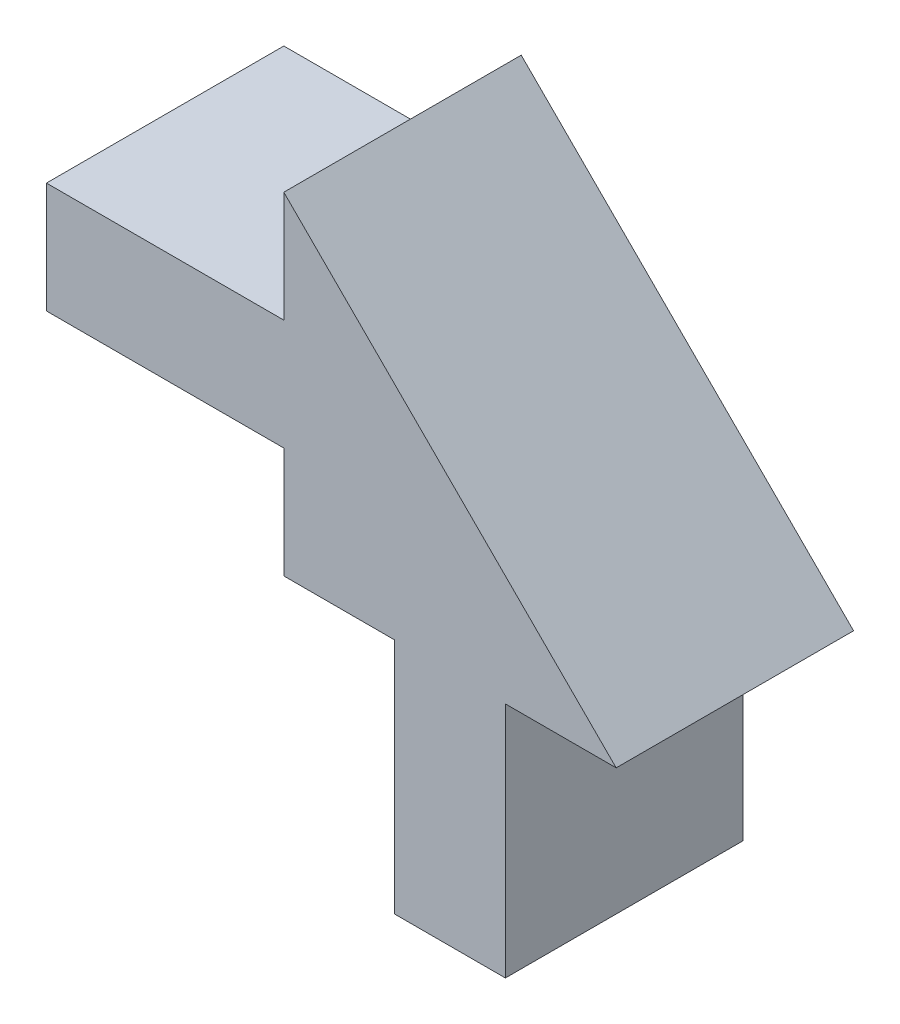
ISO-10303-21;
HEADER;
FILE_DESCRIPTION(('STEP AP214'),'2;1');
FILE_NAME('part.step','',(''),(''),'','','');
FILE_SCHEMA(('AUTOMOTIVE_DESIGN { 1 0 10303 214 1 1 1 1 }'));
ENDSEC;
DATA;
#1=APPLICATION_CONTEXT('core data for automotive mechanical design processes');
#2=APPLICATION_PROTOCOL_DEFINITION('international standard','automotive_design',2000,#1);
#3=PRODUCT_CONTEXT('',#1,'mechanical');
#4=PRODUCT('Part','Part','',(#3));
#5=PRODUCT_RELATED_PRODUCT_CATEGORY('part','',(#4));
#6=PRODUCT_DEFINITION_FORMATION('','',#4);
#7=PRODUCT_DEFINITION_CONTEXT('part definition',#1,'design');
#8=PRODUCT_DEFINITION('design','',#6,#7);
#9=PRODUCT_DEFINITION_SHAPE('','',#8);
#10=(LENGTH_UNIT() NAMED_UNIT(*) SI_UNIT(.MILLI.,.METRE.));
#11=(NAMED_UNIT(*) PLANE_ANGLE_UNIT() SI_UNIT($,.RADIAN.));
#12=(NAMED_UNIT(*) SI_UNIT($,.STERADIAN.) SOLID_ANGLE_UNIT());
#13=UNCERTAINTY_MEASURE_WITH_UNIT(LENGTH_MEASURE(1.E-05),#10,'distance_accuracy_value','');
#14=(GEOMETRIC_REPRESENTATION_CONTEXT(3) GLOBAL_UNCERTAINTY_ASSIGNED_CONTEXT((#13)) GLOBAL_UNIT_ASSIGNED_CONTEXT((#10,
#11,#12)) REPRESENTATION_CONTEXT('',''));
#15=CARTESIAN_POINT('',(0.,0.,0.));
#16=DIRECTION('',(0.,0.,1.));
#17=DIRECTION('',(1.,0.,0.));
#18=AXIS2_PLACEMENT_3D('',#15,#16,#17);
#19=CARTESIAN_POINT('',(0.,5.92666666666667,6.35));
#20=DIRECTION('',(-1.,0.,0.));
#21=DIRECTION('',(0.,0.,1.));
#22=AXIS2_PLACEMENT_3D('',#19,#20,#21);
#23=PLANE('',#22);
#24=DIRECTION('',(0.,1.,0.));
#25=VECTOR('',#24,1.);
#26=CARTESIAN_POINT('',(0.,5.92666666666667,0.));
#27=LINE('',#26,#25);
#28=CARTESIAN_POINT('',(0.,5.92666666666667,0.));
#29=VERTEX_POINT('',#28);
#30=CARTESIAN_POINT('',(0.,8.89,0.));
#31=VERTEX_POINT('',#30);
#32=EDGE_CURVE('E152',#29,#31,#27,.T.);
#33=ORIENTED_EDGE('',*,*,#32,.F.);
#34=DIRECTION('',(0.,0.,-1.));
#35=VECTOR('',#34,1.);
#36=CARTESIAN_POINT('',(0.,5.92666666666667,6.35));
#37=LINE('',#36,#35);
#38=CARTESIAN_POINT('',(0.,5.92666666666667,6.35));
#39=VERTEX_POINT('',#38);
#40=EDGE_CURVE('E11',#39,#29,#37,.T.);
#41=ORIENTED_EDGE('',*,*,#40,.F.);
#42=DIRECTION('',(0.,1.,0.));
#43=VECTOR('',#42,1.);
#44=CARTESIAN_POINT('',(0.,5.92666666666667,6.35));
#45=LINE('',#44,#43);
#46=CARTESIAN_POINT('',(0.,8.89,6.35));
#47=VERTEX_POINT('',#46);
#48=EDGE_CURVE('E177',#39,#47,#45,.T.);
#49=ORIENTED_EDGE('',*,*,#48,.T.);
#50=DIRECTION('',(0.,0.,-1.));
#51=VECTOR('',#50,1.);
#52=CARTESIAN_POINT('',(0.,8.89,6.35));
#53=LINE('',#52,#51);
#54=EDGE_CURVE('E38',#47,#31,#53,.T.);
#55=ORIENTED_EDGE('',*,*,#54,.T.);
#56=EDGE_LOOP('',(#33,#41,#49,#55));
#57=FACE_BOUND('',#56,.T.);
#58=ADVANCED_FACE('F35',(#57),#23,.T.);
#59=CARTESIAN_POINT('',(0.,5.92666666666667,6.35));
#60=DIRECTION('',(0.,-1.,0.));
#61=DIRECTION('',(0.,0.,-1.));
#62=AXIS2_PLACEMENT_3D('',#59,#60,#61);
#63=PLANE('',#62);
#64=DIRECTION('',(-1.,0.,0.));
#65=VECTOR('',#64,1.);
#66=CARTESIAN_POINT('',(0.,5.92666666666667,0.));
#67=LINE('',#66,#65);
#68=CARTESIAN_POINT('',(-6.35,5.92666666666667,0.));
#69=VERTEX_POINT('',#68);
#70=EDGE_CURVE('E89',#29,#69,#67,.T.);
#71=ORIENTED_EDGE('',*,*,#70,.T.);
#72=DIRECTION('',(0.,0.,-1.));
#73=VECTOR('',#72,1.);
#74=CARTESIAN_POINT('',(-6.35,5.92666666666667,6.35));
#75=LINE('',#74,#73);
#76=CARTESIAN_POINT('',(-6.35,5.92666666666667,6.35));
#77=VERTEX_POINT('',#76);
#78=EDGE_CURVE('E44',#77,#69,#75,.T.);
#79=ORIENTED_EDGE('',*,*,#78,.F.);
#80=DIRECTION('',(-1.,0.,0.));
#81=VECTOR('',#80,1.);
#82=CARTESIAN_POINT('',(0.,5.92666666666667,6.35));
#83=LINE('',#82,#81);
#84=EDGE_CURVE('E131',#39,#77,#83,.T.);
#85=ORIENTED_EDGE('',*,*,#84,.F.);
#86=ORIENTED_EDGE('',*,*,#40,.T.);
#87=EDGE_LOOP('',(#71,#79,#85,#86));
#88=FACE_BOUND('',#87,.T.);
#89=ADVANCED_FACE('F244',(#88),#63,.F.);
#90=CARTESIAN_POINT('',(-6.35,5.92666666666667,6.35));
#91=DIRECTION('',(1.,0.,0.));
#92=DIRECTION('',(0.,0.,-1.));
#93=AXIS2_PLACEMENT_3D('',#90,#91,#92);
#94=PLANE('',#93);
#95=DIRECTION('',(0.,-1.,0.));
#96=VECTOR('',#95,1.);
#97=CARTESIAN_POINT('',(-6.35,5.92666666666667,0.));
#98=LINE('',#97,#96);
#99=CARTESIAN_POINT('',(-6.35,2.96333333333333,0.));
#100=VERTEX_POINT('',#99);
#101=EDGE_CURVE('E138',#69,#100,#98,.T.);
#102=ORIENTED_EDGE('',*,*,#101,.T.);
#103=DIRECTION('',(0.,0.,-1.));
#104=VECTOR('',#103,1.);
#105=CARTESIAN_POINT('',(-6.35,2.96333333333333,6.35));
#106=LINE('',#105,#104);
#107=CARTESIAN_POINT('',(-6.35,2.96333333333333,6.35));
#108=VERTEX_POINT('',#107);
#109=EDGE_CURVE('E135',#108,#100,#106,.T.);
#110=ORIENTED_EDGE('',*,*,#109,.F.);
#111=DIRECTION('',(0.,-1.,0.));
#112=VECTOR('',#111,1.);
#113=CARTESIAN_POINT('',(-6.35,5.92666666666667,6.35));
#114=LINE('',#113,#112);
#115=EDGE_CURVE('E123',#77,#108,#114,.T.);
#116=ORIENTED_EDGE('',*,*,#115,.F.);
#117=ORIENTED_EDGE('',*,*,#78,.T.);
#118=EDGE_LOOP('',(#102,#110,#116,#117));
#119=FACE_BOUND('',#118,.T.);
#120=ADVANCED_FACE('F136',(#119),#94,.F.);
#121=CARTESIAN_POINT('',(0.,2.96333333333333,6.35));
#122=DIRECTION('',(0.,-1.,0.));
#123=DIRECTION('',(1.,0.,0.));
#124=AXIS2_PLACEMENT_3D('',#121,#122,#123);
#125=PLANE('',#124);
#126=DIRECTION('',(-1.,0.,0.));
#127=VECTOR('',#126,1.);
#128=CARTESIAN_POINT('',(0.,2.96333333333333,0.));
#129=LINE('',#128,#127);
#130=CARTESIAN_POINT('',(0.,2.96333333333333,0.));
#131=VERTEX_POINT('',#130);
#132=EDGE_CURVE('E174',#131,#100,#129,.T.);
#133=ORIENTED_EDGE('',*,*,#132,.F.);
#134=DIRECTION('',(0.,0.,-1.));
#135=VECTOR('',#134,1.);
#136=CARTESIAN_POINT('',(0.,2.96333333333333,6.35));
#137=LINE('',#136,#135);
#138=CARTESIAN_POINT('',(0.,2.96333333333333,6.35));
#139=VERTEX_POINT('',#138);
#140=EDGE_CURVE('E142',#139,#131,#137,.T.);
#141=ORIENTED_EDGE('',*,*,#140,.F.);
#142=DIRECTION('',(-1.,0.,0.));
#143=VECTOR('',#142,1.);
#144=CARTESIAN_POINT('',(0.,2.96333333333333,6.35));
#145=LINE('',#144,#143);
#146=EDGE_CURVE('E129',#139,#108,#145,.T.);
#147=ORIENTED_EDGE('',*,*,#146,.T.);
#148=ORIENTED_EDGE('',*,*,#109,.T.);
#149=EDGE_LOOP('',(#133,#141,#147,#148));
#150=FACE_BOUND('',#149,.T.);
#151=ADVANCED_FACE('F144',(#150),#125,.T.);
#152=CARTESIAN_POINT('',(0.,0.,6.35));
#153=DIRECTION('',(-1.,0.,0.));
#154=DIRECTION('',(0.,0.,1.));
#155=AXIS2_PLACEMENT_3D('',#152,#153,#154);
#156=PLANE('',#155);
#157=DIRECTION('',(0.,1.,0.));
#158=VECTOR('',#157,1.);
#159=CARTESIAN_POINT('',(0.,0.,0.));
#160=LINE('',#159,#158);
#161=CARTESIAN_POINT('',(0.,0.,0.));
#162=VERTEX_POINT('',#161);
#163=EDGE_CURVE('E171',#162,#131,#160,.T.);
#164=ORIENTED_EDGE('',*,*,#163,.F.);
#165=DIRECTION('',(0.,0.,-1.));
#166=VECTOR('',#165,1.);
#167=CARTESIAN_POINT('',(0.,0.,6.35));
#168=LINE('',#167,#166);
#169=CARTESIAN_POINT('',(0.,0.,6.35));
#170=VERTEX_POINT('',#169);
#171=EDGE_CURVE('E181',#170,#162,#168,.T.);
#172=ORIENTED_EDGE('',*,*,#171,.F.);
#173=DIRECTION('',(0.,1.,0.));
#174=VECTOR('',#173,1.);
#175=CARTESIAN_POINT('',(0.,0.,6.35));
#176=LINE('',#175,#174);
#177=EDGE_CURVE('E145',#170,#139,#176,.T.);
#178=ORIENTED_EDGE('',*,*,#177,.T.);
#179=ORIENTED_EDGE('',*,*,#140,.T.);
#180=EDGE_LOOP('',(#164,#172,#178,#179));
#181=FACE_BOUND('',#180,.T.);
#182=ADVANCED_FACE('F202',(#181),#156,.T.);
#183=CARTESIAN_POINT('',(0.,0.,6.35));
#184=DIRECTION('',(0.,1.,0.));
#185=DIRECTION('',(0.,0.,1.));
#186=AXIS2_PLACEMENT_3D('',#183,#184,#185);
#187=PLANE('',#186);
#188=DIRECTION('',(1.,0.,0.));
#189=VECTOR('',#188,1.);
#190=CARTESIAN_POINT('',(0.,0.,0.));
#191=LINE('',#190,#189);
#192=CARTESIAN_POINT('',(2.96333333333333,0.,0.));
#193=VERTEX_POINT('',#192);
#194=EDGE_CURVE('E169',#162,#193,#191,.T.);
#195=ORIENTED_EDGE('',*,*,#194,.T.);
#196=DIRECTION('',(0.,0.,-1.));
#197=VECTOR('',#196,1.);
#198=CARTESIAN_POINT('',(2.96333333333333,0.,6.35));
#199=LINE('',#198,#197);
#200=CARTESIAN_POINT('',(2.96333333333333,0.,6.35));
#201=VERTEX_POINT('',#200);
#202=EDGE_CURVE('E183',#201,#193,#199,.T.);
#203=ORIENTED_EDGE('',*,*,#202,.F.);
#204=DIRECTION('',(1.,0.,0.));
#205=VECTOR('',#204,1.);
#206=CARTESIAN_POINT('',(0.,0.,6.35));
#207=LINE('',#206,#205);
#208=EDGE_CURVE('E147',#170,#201,#207,.T.);
#209=ORIENTED_EDGE('',*,*,#208,.F.);
#210=ORIENTED_EDGE('',*,*,#171,.T.);
#211=EDGE_LOOP('',(#195,#203,#209,#210));
#212=FACE_BOUND('',#211,.T.);
#213=ADVANCED_FACE('F209',(#212),#187,.F.);
#214=CARTESIAN_POINT('',(2.96333333333333,0.,6.35));
#215=DIRECTION('',(1.,0.,0.));
#216=DIRECTION('',(0.,1.,0.));
#217=AXIS2_PLACEMENT_3D('',#214,#215,#216);
#218=PLANE('',#217);
#219=DIRECTION('',(0.,-1.,0.));
#220=VECTOR('',#219,1.);
#221=CARTESIAN_POINT('',(2.96333333333333,0.,0.));
#222=LINE('',#221,#220);
#223=CARTESIAN_POINT('',(2.96333333333333,-6.35,0.));
#224=VERTEX_POINT('',#223);
#225=EDGE_CURVE('E167',#193,#224,#222,.T.);
#226=ORIENTED_EDGE('',*,*,#225,.T.);
#227=DIRECTION('',(0.,0.,-1.));
#228=VECTOR('',#227,1.);
#229=CARTESIAN_POINT('',(2.96333333333333,-6.35,6.35));
#230=LINE('',#229,#228);
#231=CARTESIAN_POINT('',(2.96333333333333,-6.35,6.35));
#232=VERTEX_POINT('',#231);
#233=EDGE_CURVE('E186',#232,#224,#230,.T.);
#234=ORIENTED_EDGE('',*,*,#233,.F.);
#235=DIRECTION('',(0.,-1.,0.));
#236=VECTOR('',#235,1.);
#237=CARTESIAN_POINT('',(2.96333333333333,0.,6.35));
#238=LINE('',#237,#236);
#239=EDGE_CURVE('E206',#201,#232,#238,.T.);
#240=ORIENTED_EDGE('',*,*,#239,.F.);
#241=ORIENTED_EDGE('',*,*,#202,.T.);
#242=EDGE_LOOP('',(#226,#234,#240,#241));
#243=FACE_BOUND('',#242,.T.);
#244=ADVANCED_FACE('F211',(#243),#218,.F.);
#245=CARTESIAN_POINT('',(2.96333333333333,-6.35,6.35));
#246=DIRECTION('',(0.,1.,0.));
#247=DIRECTION('',(0.,0.,1.));
#248=AXIS2_PLACEMENT_3D('',#245,#246,#247);
#249=PLANE('',#248);
#250=DIRECTION('',(1.,0.,0.));
#251=VECTOR('',#250,1.);
#252=CARTESIAN_POINT('',(2.96333333333333,-6.35,0.));
#253=LINE('',#252,#251);
#254=CARTESIAN_POINT('',(5.92666666666667,-6.35,0.));
#255=VERTEX_POINT('',#254);
#256=EDGE_CURVE('E164',#224,#255,#253,.T.);
#257=ORIENTED_EDGE('',*,*,#256,.T.);
#258=DIRECTION('',(0.,0.,-1.));
#259=VECTOR('',#258,1.);
#260=CARTESIAN_POINT('',(5.92666666666667,-6.35,6.35));
#261=LINE('',#260,#259);
#262=CARTESIAN_POINT('',(5.92666666666667,-6.35,6.35));
#263=VERTEX_POINT('',#262);
#264=EDGE_CURVE('E189',#263,#255,#261,.T.);
#265=ORIENTED_EDGE('',*,*,#264,.F.);
#266=DIRECTION('',(1.,0.,0.));
#267=VECTOR('',#266,1.);
#268=CARTESIAN_POINT('',(2.96333333333333,-6.35,6.35));
#269=LINE('',#268,#267);
#270=EDGE_CURVE('E213',#232,#263,#269,.T.);
#271=ORIENTED_EDGE('',*,*,#270,.F.);
#272=ORIENTED_EDGE('',*,*,#233,.T.);
#273=EDGE_LOOP('',(#257,#265,#271,#272));
#274=FACE_BOUND('',#273,.T.);
#275=ADVANCED_FACE('F234',(#274),#249,.F.);
#276=CARTESIAN_POINT('',(5.92666666666666,0.,6.35));
#277=DIRECTION('',(1.,0.,0.));
#278=DIRECTION('',(0.,1.,0.));
#279=AXIS2_PLACEMENT_3D('',#276,#277,#278);
#280=PLANE('',#279);
#281=DIRECTION('',(0.,-1.,0.));
#282=VECTOR('',#281,1.);
#283=CARTESIAN_POINT('',(5.92666666666666,0.,0.));
#284=LINE('',#283,#282);
#285=CARTESIAN_POINT('',(5.92666666666666,0.,0.));
#286=VERTEX_POINT('',#285);
#287=EDGE_CURVE('E161',#286,#255,#284,.T.);
#288=ORIENTED_EDGE('',*,*,#287,.F.);
#289=DIRECTION('',(0.,0.,-1.));
#290=VECTOR('',#289,1.);
#291=CARTESIAN_POINT('',(5.92666666666666,0.,6.35));
#292=LINE('',#291,#290);
#293=CARTESIAN_POINT('',(5.92666666666666,0.,6.35));
#294=VERTEX_POINT('',#293);
#295=EDGE_CURVE('E191',#294,#286,#292,.T.);
#296=ORIENTED_EDGE('',*,*,#295,.F.);
#297=DIRECTION('',(0.,-1.,0.));
#298=VECTOR('',#297,1.);
#299=CARTESIAN_POINT('',(5.92666666666666,0.,6.35));
#300=LINE('',#299,#298);
#301=EDGE_CURVE('E215',#294,#263,#300,.T.);
#302=ORIENTED_EDGE('',*,*,#301,.T.);
#303=ORIENTED_EDGE('',*,*,#264,.T.);
#304=EDGE_LOOP('',(#288,#296,#302,#303));
#305=FACE_BOUND('',#304,.T.);
#306=ADVANCED_FACE('F231',(#305),#280,.T.);
#307=CARTESIAN_POINT('',(5.92666666666666,0.,6.35));
#308=DIRECTION('',(0.,1.,0.));
#309=DIRECTION('',(0.,0.,1.));
#310=AXIS2_PLACEMENT_3D('',#307,#308,#309);
#311=PLANE('',#310);
#312=DIRECTION('',(1.,0.,0.));
#313=VECTOR('',#312,1.);
#314=CARTESIAN_POINT('',(5.92666666666666,0.,0.));
#315=LINE('',#314,#313);
#316=CARTESIAN_POINT('',(8.89,0.,0.));
#317=VERTEX_POINT('',#316);
#318=EDGE_CURVE('E158',#286,#317,#315,.T.);
#319=ORIENTED_EDGE('',*,*,#318,.T.);
#320=DIRECTION('',(0.,0.,-1.));
#321=VECTOR('',#320,1.);
#322=CARTESIAN_POINT('',(8.89,0.,6.35));
#323=LINE('',#322,#321);
#324=CARTESIAN_POINT('',(8.89,0.,6.35));
#325=VERTEX_POINT('',#324);
#326=EDGE_CURVE('E192',#325,#317,#323,.T.);
#327=ORIENTED_EDGE('',*,*,#326,.F.);
#328=DIRECTION('',(1.,0.,0.));
#329=VECTOR('',#328,1.);
#330=CARTESIAN_POINT('',(5.92666666666666,0.,6.35));
#331=LINE('',#330,#329);
#332=EDGE_CURVE('E220',#294,#325,#331,.T.);
#333=ORIENTED_EDGE('',*,*,#332,.F.);
#334=ORIENTED_EDGE('',*,*,#295,.T.);
#335=EDGE_LOOP('',(#319,#327,#333,#334));
#336=FACE_BOUND('',#335,.T.);
#337=ADVANCED_FACE('F227',(#336),#311,.F.);
#338=CARTESIAN_POINT('',(0.,8.89,6.35));
#339=DIRECTION('',(0.707106781186548,0.707106781186548,0.));
#340=DIRECTION('',(-0.707106781186548,0.707106781186548,0.));
#341=AXIS2_PLACEMENT_3D('',#338,#339,#340);
#342=PLANE('',#341);
#343=DIRECTION('',(0.707106781186548,-0.707106781186548,0.));
#344=VECTOR('',#343,1.);
#345=CARTESIAN_POINT('',(0.,8.89,0.));
#346=LINE('',#345,#344);
#347=EDGE_CURVE('E155',#31,#317,#346,.T.);
#348=ORIENTED_EDGE('',*,*,#347,.F.);
#349=ORIENTED_EDGE('',*,*,#54,.F.);
#350=DIRECTION('',(0.707106781186548,-0.707106781186548,0.));
#351=VECTOR('',#350,1.);
#352=CARTESIAN_POINT('',(0.,8.89,6.35));
#353=LINE('',#352,#351);
#354=EDGE_CURVE('E222',#47,#325,#353,.T.);
#355=ORIENTED_EDGE('',*,*,#354,.T.);
#356=ORIENTED_EDGE('',*,*,#326,.T.);
#357=EDGE_LOOP('',(#348,#349,#355,#356));
#358=FACE_BOUND('',#357,.T.);
#359=ADVANCED_FACE('F194',(#358),#342,.T.);
#360=CARTESIAN_POINT('',(0.,0.,6.35));
#361=DIRECTION('',(0.,0.,-1.));
#362=DIRECTION('',(-1.,0.,0.));
#363=AXIS2_PLACEMENT_3D('',#360,#361,#362);
#364=PLANE('',#363);
#365=ORIENTED_EDGE('',*,*,#48,.F.);
#366=ORIENTED_EDGE('',*,*,#84,.T.);
#367=ORIENTED_EDGE('',*,*,#115,.T.);
#368=ORIENTED_EDGE('',*,*,#146,.F.);
#369=ORIENTED_EDGE('',*,*,#177,.F.);
#370=ORIENTED_EDGE('',*,*,#208,.T.);
#371=ORIENTED_EDGE('',*,*,#239,.T.);
#372=ORIENTED_EDGE('',*,*,#270,.T.);
#373=ORIENTED_EDGE('',*,*,#301,.F.);
#374=ORIENTED_EDGE('',*,*,#332,.T.);
#375=ORIENTED_EDGE('',*,*,#354,.F.);
#376=EDGE_LOOP('',(#365,#366,#367,#368,#369,#370,#371,#372,#373,#374,#375));
#377=FACE_BOUND('',#376,.T.);
#378=ADVANCED_FACE('F126',(#377),#364,.F.);
#379=CARTESIAN_POINT('',(0.,0.,0.));
#380=DIRECTION('',(0.,0.,-1.));
#381=DIRECTION('',(-1.,0.,0.));
#382=AXIS2_PLACEMENT_3D('',#379,#380,#381);
#383=PLANE('',#382);
#384=ORIENTED_EDGE('',*,*,#32,.T.);
#385=ORIENTED_EDGE('',*,*,#347,.T.);
#386=ORIENTED_EDGE('',*,*,#318,.F.);
#387=ORIENTED_EDGE('',*,*,#287,.T.);
#388=ORIENTED_EDGE('',*,*,#256,.F.);
#389=ORIENTED_EDGE('',*,*,#225,.F.);
#390=ORIENTED_EDGE('',*,*,#194,.F.);
#391=ORIENTED_EDGE('',*,*,#163,.T.);
#392=ORIENTED_EDGE('',*,*,#132,.T.);
#393=ORIENTED_EDGE('',*,*,#101,.F.);
#394=ORIENTED_EDGE('',*,*,#70,.F.);
#395=EDGE_LOOP('',(#384,#385,#386,#387,#388,#389,#390,#391,#392,#393,#394));
#396=FACE_BOUND('',#395,.T.);
#397=ADVANCED_FACE('F197',(#396),#383,.T.);
#398=CLOSED_SHELL('',(#58,#89,#120,#151,#182,#213,#244,#275,#306,#337,#359,#378,#397));
#399=MANIFOLD_SOLID_BREP('B2',#398);
#400=ADVANCED_BREP_SHAPE_REPRESENTATION('',(#18,#399),#14);
#401=SHAPE_DEFINITION_REPRESENTATION(#9,#400);
ENDSEC;
END-ISO-10303-21;
